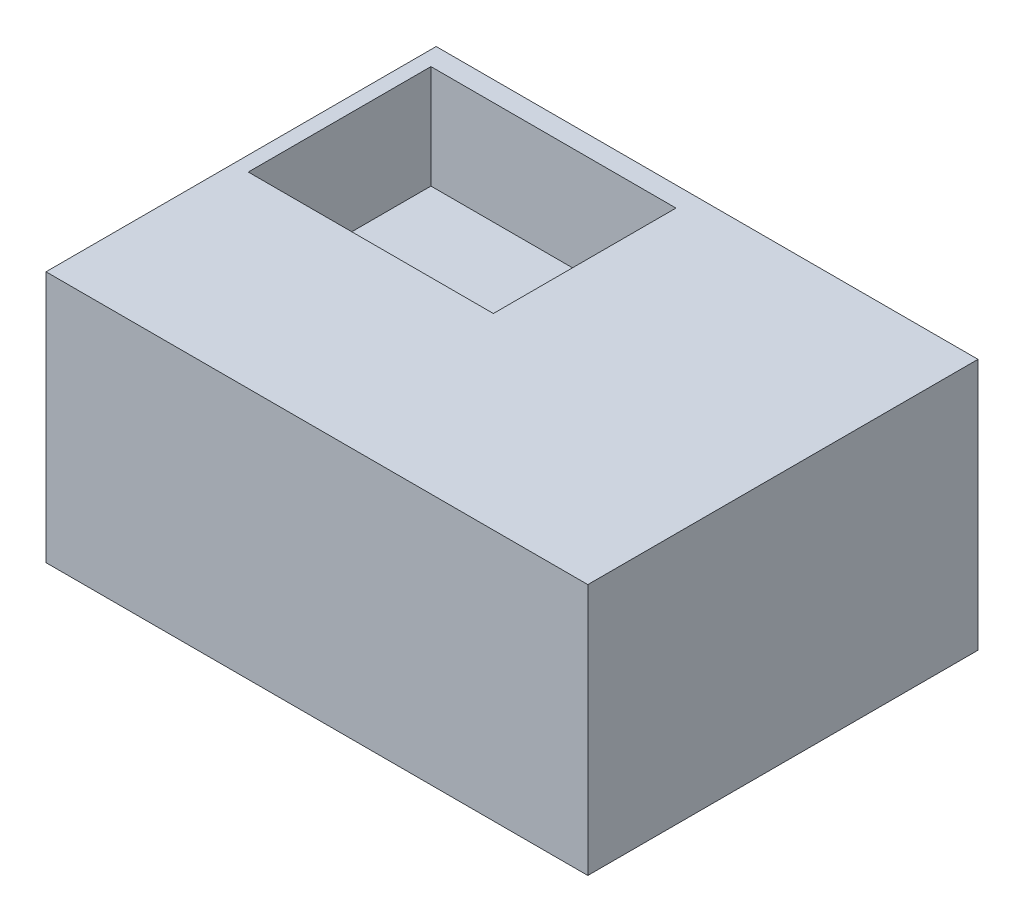
ISO-10303-21;
HEADER;
FILE_DESCRIPTION(('STEP AP214'),'2;1');
FILE_NAME('part.step','',(''),(''),'','','');
FILE_SCHEMA(('AUTOMOTIVE_DESIGN { 1 0 10303 214 1 1 1 1 }'));
ENDSEC;
DATA;
#1=APPLICATION_CONTEXT('core data for automotive mechanical design processes');
#2=APPLICATION_PROTOCOL_DEFINITION('international standard','automotive_design',2000,#1);
#3=PRODUCT_CONTEXT('',#1,'mechanical');
#4=PRODUCT('Part','Part','',(#3));
#5=PRODUCT_RELATED_PRODUCT_CATEGORY('part','',(#4));
#6=PRODUCT_DEFINITION_FORMATION('','',#4);
#7=PRODUCT_DEFINITION_CONTEXT('part definition',#1,'design');
#8=PRODUCT_DEFINITION('design','',#6,#7);
#9=PRODUCT_DEFINITION_SHAPE('','',#8);
#10=(LENGTH_UNIT() NAMED_UNIT(*) SI_UNIT(.MILLI.,.METRE.));
#11=(NAMED_UNIT(*) PLANE_ANGLE_UNIT() SI_UNIT($,.RADIAN.));
#12=(NAMED_UNIT(*) SI_UNIT($,.STERADIAN.) SOLID_ANGLE_UNIT());
#13=UNCERTAINTY_MEASURE_WITH_UNIT(LENGTH_MEASURE(1.E-05),#10,'distance_accuracy_value','');
#14=(GEOMETRIC_REPRESENTATION_CONTEXT(3) GLOBAL_UNCERTAINTY_ASSIGNED_CONTEXT((#13)) GLOBAL_UNIT_ASSIGNED_CONTEXT((#10,
#11,#12)) REPRESENTATION_CONTEXT('',''));
#15=CARTESIAN_POINT('',(0.,0.,0.));
#16=DIRECTION('',(0.,0.,1.));
#17=DIRECTION('',(1.,0.,0.));
#18=AXIS2_PLACEMENT_3D('',#15,#16,#17);
#19=CARTESIAN_POINT('',(62.6787694079176,56.,43.3638616145412));
#20=DIRECTION('',(-1.,0.,0.));
#21=DIRECTION('',(0.,0.,1.));
#22=AXIS2_PLACEMENT_3D('',#19,#20,#21);
#23=PLANE('',#22);
#24=DIRECTION('',(0.,0.,-1.));
#25=VECTOR('',#24,1.);
#26=CARTESIAN_POINT('',(62.6787694079176,0.,43.3638616145412));
#27=LINE('',#26,#25);
#28=CARTESIAN_POINT('',(62.6787694079176,0.,43.3638616145412));
#29=VERTEX_POINT('',#28);
#30=CARTESIAN_POINT('',(62.6787694079176,0.,-43.3638616145412));
#31=VERTEX_POINT('',#30);
#32=EDGE_CURVE('E962',#29,#31,#27,.T.);
#33=ORIENTED_EDGE('',*,*,#32,.T.);
#34=DIRECTION('',(0.,-1.,0.));
#35=VECTOR('',#34,1.);
#36=CARTESIAN_POINT('',(62.6787694079176,56.,-43.3638616145412));
#37=LINE('',#36,#35);
#38=CARTESIAN_POINT('',(62.6787694079176,56.,-43.3638616145412));
#39=VERTEX_POINT('',#38);
#40=EDGE_CURVE('E15',#39,#31,#37,.T.);
#41=ORIENTED_EDGE('',*,*,#40,.F.);
#42=DIRECTION('',(0.,0.,-1.));
#43=VECTOR('',#42,1.);
#44=CARTESIAN_POINT('',(62.6787694079176,56.,43.3638616145412));
#45=LINE('',#44,#43);
#46=CARTESIAN_POINT('',(62.6787694079176,56.,43.3638616145412));
#47=VERTEX_POINT('',#46);
#48=EDGE_CURVE('E966',#47,#39,#45,.T.);
#49=ORIENTED_EDGE('',*,*,#48,.F.);
#50=DIRECTION('',(0.,-1.,0.));
#51=VECTOR('',#50,1.);
#52=CARTESIAN_POINT('',(62.6787694079176,56.,43.3638616145412));
#53=LINE('',#52,#51);
#54=EDGE_CURVE('E972',#47,#29,#53,.T.);
#55=ORIENTED_EDGE('',*,*,#54,.T.);
#56=EDGE_LOOP('',(#33,#41,#49,#55));
#57=FACE_BOUND('',#56,.T.);
#58=ADVANCED_FACE('F854',(#57),#23,.F.);
#59=CARTESIAN_POINT('',(-57.7553615390177,56.,-43.3638616145412));
#60=DIRECTION('',(0.,0.,1.));
#61=DIRECTION('',(1.,0.,0.));
#62=AXIS2_PLACEMENT_3D('',#59,#60,#61);
#63=PLANE('',#62);
#64=DIRECTION('',(-1.,0.,0.));
#65=VECTOR('',#64,1.);
#66=CARTESIAN_POINT('',(-57.7553615390177,0.,-43.3638616145412));
#67=LINE('',#66,#65);
#68=CARTESIAN_POINT('',(-57.7553615390177,0.,-43.3638616145412));
#69=VERTEX_POINT('',#68);
#70=EDGE_CURVE('E975',#31,#69,#67,.T.);
#71=ORIENTED_EDGE('',*,*,#70,.T.);
#72=DIRECTION('',(0.,-1.,0.));
#73=VECTOR('',#72,1.);
#74=CARTESIAN_POINT('',(-57.7553615390177,56.,-43.3638616145412));
#75=LINE('',#74,#73);
#76=CARTESIAN_POINT('',(-57.7553615390177,56.,-43.3638616145412));
#77=VERTEX_POINT('',#76);
#78=EDGE_CURVE('E861',#77,#69,#75,.T.);
#79=ORIENTED_EDGE('',*,*,#78,.F.);
#80=DIRECTION('',(-1.,0.,0.));
#81=VECTOR('',#80,1.);
#82=CARTESIAN_POINT('',(-57.7553615390177,56.,-43.3638616145412));
#83=LINE('',#82,#81);
#84=EDGE_CURVE('E905',#39,#77,#83,.T.);
#85=ORIENTED_EDGE('',*,*,#84,.F.);
#86=ORIENTED_EDGE('',*,*,#40,.T.);
#87=EDGE_LOOP('',(#71,#79,#85,#86));
#88=FACE_BOUND('',#87,.T.);
#89=ADVANCED_FACE('F1004',(#88),#63,.F.);
#90=CARTESIAN_POINT('',(-57.7553615390177,56.,43.3638616145412));
#91=DIRECTION('',(1.,0.,0.));
#92=DIRECTION('',(0.,0.,-1.));
#93=AXIS2_PLACEMENT_3D('',#90,#91,#92);
#94=PLANE('',#93);
#95=DIRECTION('',(0.,0.,1.));
#96=VECTOR('',#95,1.);
#97=CARTESIAN_POINT('',(-57.7553615390177,0.,43.3638616145412));
#98=LINE('',#97,#96);
#99=CARTESIAN_POINT('',(-57.7553615390177,0.,43.3638616145412));
#100=VERTEX_POINT('',#99);
#101=EDGE_CURVE('E977',#69,#100,#98,.T.);
#102=ORIENTED_EDGE('',*,*,#101,.T.);
#103=DIRECTION('',(0.,-1.,0.));
#104=VECTOR('',#103,1.);
#105=CARTESIAN_POINT('',(-57.7553615390177,56.,43.3638616145412));
#106=LINE('',#105,#104);
#107=CARTESIAN_POINT('',(-57.7553615390177,56.,43.3638616145412));
#108=VERTEX_POINT('',#107);
#109=EDGE_CURVE('E981',#108,#100,#106,.T.);
#110=ORIENTED_EDGE('',*,*,#109,.F.);
#111=DIRECTION('',(0.,0.,1.));
#112=VECTOR('',#111,1.);
#113=CARTESIAN_POINT('',(-57.7553615390177,56.,43.3638616145412));
#114=LINE('',#113,#112);
#115=EDGE_CURVE('E969',#77,#108,#114,.T.);
#116=ORIENTED_EDGE('',*,*,#115,.F.);
#117=ORIENTED_EDGE('',*,*,#78,.T.);
#118=EDGE_LOOP('',(#102,#110,#116,#117));
#119=FACE_BOUND('',#118,.T.);
#120=ADVANCED_FACE('F986',(#119),#94,.F.);
#121=CARTESIAN_POINT('',(-57.7553615390177,56.,43.3638616145412));
#122=DIRECTION('',(0.,0.,-1.));
#123=DIRECTION('',(-1.,0.,0.));
#124=AXIS2_PLACEMENT_3D('',#121,#122,#123);
#125=PLANE('',#124);
#126=DIRECTION('',(1.,0.,0.));
#127=VECTOR('',#126,1.);
#128=CARTESIAN_POINT('',(-57.7553615390177,0.,43.3638616145412));
#129=LINE('',#128,#127);
#130=EDGE_CURVE('E898',#100,#29,#129,.T.);
#131=ORIENTED_EDGE('',*,*,#130,.T.);
#132=ORIENTED_EDGE('',*,*,#54,.F.);
#133=DIRECTION('',(1.,0.,0.));
#134=VECTOR('',#133,1.);
#135=CARTESIAN_POINT('',(-57.7553615390177,56.,43.3638616145412));
#136=LINE('',#135,#134);
#137=EDGE_CURVE('E877',#108,#47,#136,.T.);
#138=ORIENTED_EDGE('',*,*,#137,.F.);
#139=ORIENTED_EDGE('',*,*,#109,.T.);
#140=EDGE_LOOP('',(#131,#132,#138,#139));
#141=FACE_BOUND('',#140,.T.);
#142=ADVANCED_FACE('F994',(#141),#125,.F.);
#143=CARTESIAN_POINT('',(0.,56.,0.));
#144=DIRECTION('',(0.,-1.,0.));
#145=DIRECTION('',(0.,0.,-1.));
#146=AXIS2_PLACEMENT_3D('',#143,#144,#145);
#147=PLANE('',#146);
#148=DIRECTION('',(1.,0.,0.));
#149=VECTOR('',#148,1.);
#150=CARTESIAN_POINT('',(-54.4714093915663,56.,1.68323987224724));
#151=LINE('',#150,#149);
#152=CARTESIAN_POINT('',(-54.4714093915663,56.,1.68323987224724));
#153=VERTEX_POINT('',#152);
#154=CARTESIAN_POINT('',(0.,56.,1.68323987224724));
#155=VERTEX_POINT('',#154);
#156=EDGE_CURVE('E956',#153,#155,#151,.T.);
#157=ORIENTED_EDGE('',*,*,#156,.F.);
#158=DIRECTION('',(0.,0.,1.));
#159=VECTOR('',#158,1.);
#160=CARTESIAN_POINT('',(-54.4714093915663,56.,-38.9125452819557));
#161=LINE('',#160,#159);
#162=CARTESIAN_POINT('',(-54.4714093915663,56.,-38.9125452819557));
#163=VERTEX_POINT('',#162);
#164=EDGE_CURVE('E868',#163,#153,#161,.T.);
#165=ORIENTED_EDGE('',*,*,#164,.F.);
#166=DIRECTION('',(-1.,0.,0.));
#167=VECTOR('',#166,1.);
#168=CARTESIAN_POINT('',(-54.4714093915663,56.,-38.9125452819557));
#169=LINE('',#168,#167);
#170=CARTESIAN_POINT('',(0.,56.,-38.9125452819557));
#171=VERTEX_POINT('',#170);
#172=EDGE_CURVE('E947',#171,#163,#169,.T.);
#173=ORIENTED_EDGE('',*,*,#172,.F.);
#174=DIRECTION('',(0.,0.,-1.));
#175=VECTOR('',#174,1.);
#176=CARTESIAN_POINT('',(0.,56.,-38.9125452819557));
#177=LINE('',#176,#175);
#178=EDGE_CURVE('E950',#155,#171,#177,.T.);
#179=ORIENTED_EDGE('',*,*,#178,.F.);
#180=EDGE_LOOP('',(#157,#165,#173,#179));
#181=FACE_BOUND('',#180,.T.);
#182=ORIENTED_EDGE('',*,*,#48,.T.);
#183=ORIENTED_EDGE('',*,*,#84,.T.);
#184=ORIENTED_EDGE('',*,*,#115,.T.);
#185=ORIENTED_EDGE('',*,*,#137,.T.);
#186=EDGE_LOOP('',(#182,#183,#184,#185));
#187=FACE_BOUND('',#186,.T.);
#188=ADVANCED_FACE('F996',(#181,#187),#147,.F.);
#189=CARTESIAN_POINT('',(0.,0.,0.));
#190=DIRECTION('',(0.,-1.,0.));
#191=DIRECTION('',(0.,0.,-1.));
#192=AXIS2_PLACEMENT_3D('',#189,#190,#191);
#193=PLANE('',#192);
#194=ORIENTED_EDGE('',*,*,#32,.F.);
#195=ORIENTED_EDGE('',*,*,#130,.F.);
#196=ORIENTED_EDGE('',*,*,#101,.F.);
#197=ORIENTED_EDGE('',*,*,#70,.F.);
#198=EDGE_LOOP('',(#194,#195,#196,#197));
#199=FACE_BOUND('',#198,.T.);
#200=ADVANCED_FACE('F990',(#199),#193,.T.);
#201=CARTESIAN_POINT('',(-54.4714093915663,33.,-38.9125452819557));
#202=DIRECTION('',(-1.,0.,0.));
#203=DIRECTION('',(0.,0.,1.));
#204=AXIS2_PLACEMENT_3D('',#201,#202,#203);
#205=PLANE('',#204);
#206=ORIENTED_EDGE('',*,*,#164,.T.);
#207=DIRECTION('',(0.,1.,0.));
#208=VECTOR('',#207,1.);
#209=CARTESIAN_POINT('',(-54.4714093915663,33.,1.68323987224724));
#210=LINE('',#209,#208);
#211=CARTESIAN_POINT('',(-54.4714093915663,33.,1.68323987224724));
#212=VERTEX_POINT('',#211);
#213=EDGE_CURVE('E925',#212,#153,#210,.T.);
#214=ORIENTED_EDGE('',*,*,#213,.F.);
#215=DIRECTION('',(0.,0.,1.));
#216=VECTOR('',#215,1.);
#217=CARTESIAN_POINT('',(-54.4714093915663,33.,-38.9125452819557));
#218=LINE('',#217,#216);
#219=CARTESIAN_POINT('',(-54.4714093915663,33.,-38.9125452819557));
#220=VERTEX_POINT('',#219);
#221=EDGE_CURVE('E929',#220,#212,#218,.T.);
#222=ORIENTED_EDGE('',*,*,#221,.F.);
#223=DIRECTION('',(0.,1.,0.));
#224=VECTOR('',#223,1.);
#225=CARTESIAN_POINT('',(-54.4714093915663,33.,-38.9125452819557));
#226=LINE('',#225,#224);
#227=EDGE_CURVE('E960',#220,#163,#226,.T.);
#228=ORIENTED_EDGE('',*,*,#227,.T.);
#229=EDGE_LOOP('',(#206,#214,#222,#228));
#230=FACE_BOUND('',#229,.T.);
#231=ADVANCED_FACE('F927',(#230),#205,.F.);
#232=CARTESIAN_POINT('',(-54.4714093915663,33.,-38.9125452819557));
#233=DIRECTION('',(0.,0.,-1.));
#234=DIRECTION('',(-1.,0.,0.));
#235=AXIS2_PLACEMENT_3D('',#232,#233,#234);
#236=PLANE('',#235);
#237=ORIENTED_EDGE('',*,*,#172,.T.);
#238=ORIENTED_EDGE('',*,*,#227,.F.);
#239=DIRECTION('',(-1.,0.,0.));
#240=VECTOR('',#239,1.);
#241=CARTESIAN_POINT('',(-54.4714093915663,33.,-38.9125452819557));
#242=LINE('',#241,#240);
#243=CARTESIAN_POINT('',(0.,33.,-38.9125452819557));
#244=VERTEX_POINT('',#243);
#245=EDGE_CURVE('E935',#244,#220,#242,.T.);
#246=ORIENTED_EDGE('',*,*,#245,.F.);
#247=DIRECTION('',(0.,1.,0.));
#248=VECTOR('',#247,1.);
#249=CARTESIAN_POINT('',(0.,33.,-38.9125452819557));
#250=LINE('',#249,#248);
#251=EDGE_CURVE('E963',#244,#171,#250,.T.);
#252=ORIENTED_EDGE('',*,*,#251,.T.);
#253=EDGE_LOOP('',(#237,#238,#246,#252));
#254=FACE_BOUND('',#253,.T.);
#255=ADVANCED_FACE('F1043',(#254),#236,.F.);
#256=CARTESIAN_POINT('',(0.,33.,-38.9125452819557));
#257=DIRECTION('',(1.,0.,0.));
#258=DIRECTION('',(0.,0.,-1.));
#259=AXIS2_PLACEMENT_3D('',#256,#257,#258);
#260=PLANE('',#259);
#261=ORIENTED_EDGE('',*,*,#178,.T.);
#262=ORIENTED_EDGE('',*,*,#251,.F.);
#263=DIRECTION('',(0.,0.,-1.));
#264=VECTOR('',#263,1.);
#265=CARTESIAN_POINT('',(0.,33.,-38.9125452819557));
#266=LINE('',#265,#264);
#267=CARTESIAN_POINT('',(0.,33.,1.68323987224724));
#268=VERTEX_POINT('',#267);
#269=EDGE_CURVE('E943',#268,#244,#266,.T.);
#270=ORIENTED_EDGE('',*,*,#269,.F.);
#271=DIRECTION('',(0.,1.,0.));
#272=VECTOR('',#271,1.);
#273=CARTESIAN_POINT('',(0.,33.,1.68323987224724));
#274=LINE('',#273,#272);
#275=EDGE_CURVE('E934',#268,#155,#274,.T.);
#276=ORIENTED_EDGE('',*,*,#275,.T.);
#277=EDGE_LOOP('',(#261,#262,#270,#276));
#278=FACE_BOUND('',#277,.T.);
#279=ADVANCED_FACE('F1052',(#278),#260,.F.);
#280=CARTESIAN_POINT('',(-54.4714093915663,33.,1.68323987224724));
#281=DIRECTION('',(0.,0.,1.));
#282=DIRECTION('',(1.,0.,0.));
#283=AXIS2_PLACEMENT_3D('',#280,#281,#282);
#284=PLANE('',#283);
#285=ORIENTED_EDGE('',*,*,#156,.T.);
#286=ORIENTED_EDGE('',*,*,#275,.F.);
#287=DIRECTION('',(1.,0.,0.));
#288=VECTOR('',#287,1.);
#289=CARTESIAN_POINT('',(-54.4714093915663,33.,1.68323987224724));
#290=LINE('',#289,#288);
#291=EDGE_CURVE('E938',#212,#268,#290,.T.);
#292=ORIENTED_EDGE('',*,*,#291,.F.);
#293=ORIENTED_EDGE('',*,*,#213,.T.);
#294=EDGE_LOOP('',(#285,#286,#292,#293));
#295=FACE_BOUND('',#294,.T.);
#296=ADVANCED_FACE('F939',(#295),#284,.F.);
#297=CARTESIAN_POINT('',(0.,33.,0.));
#298=DIRECTION('',(0.,1.,0.));
#299=DIRECTION('',(0.,0.,1.));
#300=AXIS2_PLACEMENT_3D('',#297,#298,#299);
#301=PLANE('',#300);
#302=ORIENTED_EDGE('',*,*,#221,.T.);
#303=ORIENTED_EDGE('',*,*,#291,.T.);
#304=ORIENTED_EDGE('',*,*,#269,.T.);
#305=ORIENTED_EDGE('',*,*,#245,.T.);
#306=EDGE_LOOP('',(#302,#303,#304,#305));
#307=FACE_BOUND('',#306,.T.);
#308=ADVANCED_FACE('F945',(#307),#301,.T.);
#309=CLOSED_SHELL('',(#58,#89,#120,#142,#188,#200,#231,#255,#279,#296,#308));
#310=MANIFOLD_SOLID_BREP('B2',#309);
#311=ADVANCED_BREP_SHAPE_REPRESENTATION('',(#18,#310),#14);
#312=SHAPE_DEFINITION_REPRESENTATION(#9,#311);
ENDSEC;
END-ISO-10303-21;
